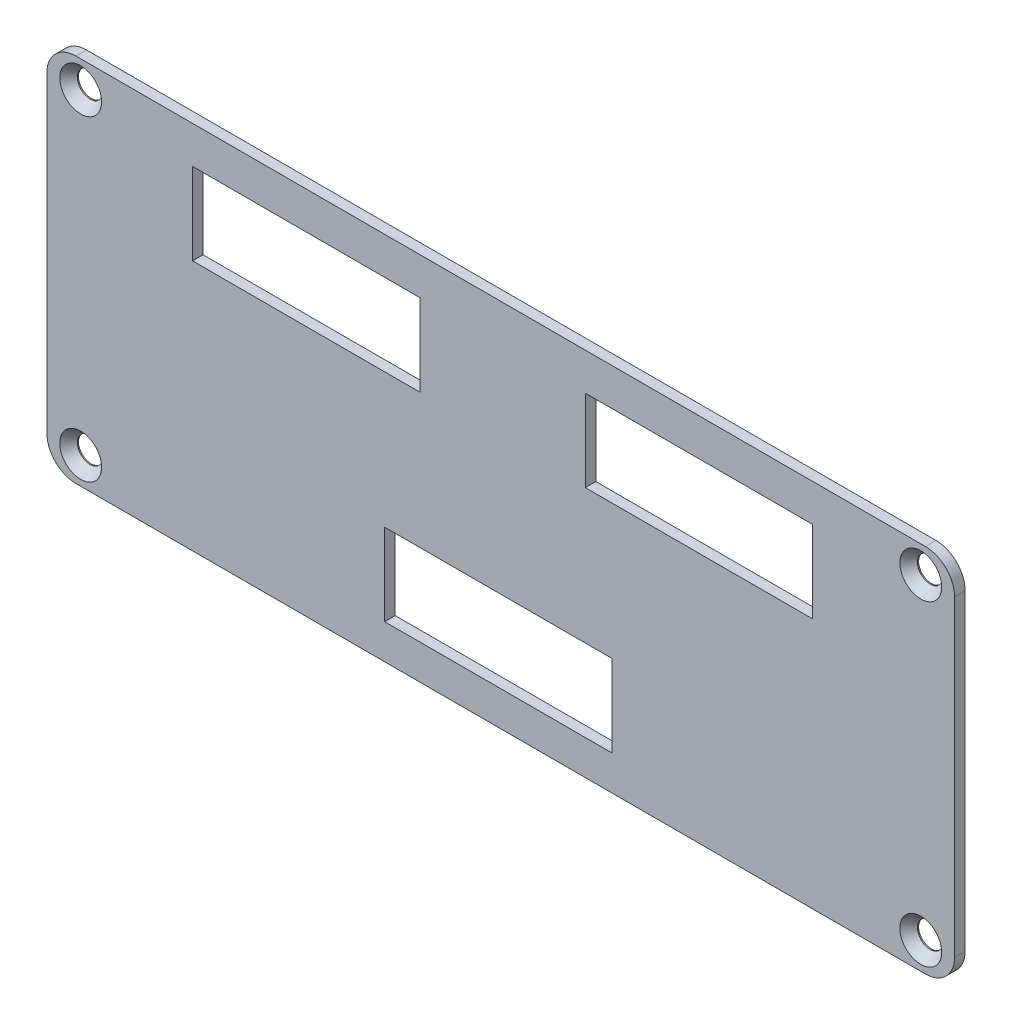
ISO-10303-21;
HEADER;
FILE_DESCRIPTION(('STEP AP214'),'2;1');
FILE_NAME('part.step','',(''),(''),'','','');
FILE_SCHEMA(('AUTOMOTIVE_DESIGN { 1 0 10303 214 1 1 1 1 }'));
ENDSEC;
DATA;
#1=APPLICATION_CONTEXT('core data for automotive mechanical design processes');
#2=APPLICATION_PROTOCOL_DEFINITION('international standard','automotive_design',2000,#1);
#3=PRODUCT_CONTEXT('',#1,'mechanical');
#4=PRODUCT('Part','Part','',(#3));
#5=PRODUCT_RELATED_PRODUCT_CATEGORY('part','',(#4));
#6=PRODUCT_DEFINITION_FORMATION('','',#4);
#7=PRODUCT_DEFINITION_CONTEXT('part definition',#1,'design');
#8=PRODUCT_DEFINITION('design','',#6,#7);
#9=PRODUCT_DEFINITION_SHAPE('','',#8);
#10=(LENGTH_UNIT() NAMED_UNIT(*) SI_UNIT(.MILLI.,.METRE.));
#11=(NAMED_UNIT(*) PLANE_ANGLE_UNIT() SI_UNIT($,.RADIAN.));
#12=(NAMED_UNIT(*) SI_UNIT($,.STERADIAN.) SOLID_ANGLE_UNIT());
#13=UNCERTAINTY_MEASURE_WITH_UNIT(LENGTH_MEASURE(1.E-05),#10,'distance_accuracy_value','');
#14=(GEOMETRIC_REPRESENTATION_CONTEXT(3) GLOBAL_UNCERTAINTY_ASSIGNED_CONTEXT((#13)) GLOBAL_UNIT_ASSIGNED_CONTEXT((#10,
#11,#12)) REPRESENTATION_CONTEXT('',''));
#15=CARTESIAN_POINT('',(0.,0.,0.));
#16=DIRECTION('',(0.,0.,1.));
#17=DIRECTION('',(1.,0.,0.));
#18=AXIS2_PLACEMENT_3D('',#15,#16,#17);
#19=CARTESIAN_POINT('',(0.,0.,1.45));
#20=DIRECTION('',(1.,0.,0.));
#21=DIRECTION('',(0.,1.,0.));
#22=AXIS2_PLACEMENT_3D('',#19,#20,#21);
#23=PLANE('',#22);
#24=DIRECTION('',(0.,-1.,0.));
#25=VECTOR('',#24,1.);
#26=CARTESIAN_POINT('',(0.,0.,1.45));
#27=LINE('',#26,#25);
#28=CARTESIAN_POINT('',(0.,-4.,1.45));
#29=VERTEX_POINT('',#28);
#30=CARTESIAN_POINT('',(0.,-46.9,1.45));
#31=VERTEX_POINT('',#30);
#32=EDGE_CURVE('E305',#29,#31,#27,.T.);
#33=ORIENTED_EDGE('',*,*,#32,.F.);
#34=DIRECTION('',(0.,0.,-1.));
#35=VECTOR('',#34,1.);
#36=CARTESIAN_POINT('',(0.,-4.,1.45));
#37=LINE('',#36,#35);
#38=CARTESIAN_POINT('',(0.,-4.,0.));
#39=VERTEX_POINT('',#38);
#40=EDGE_CURVE('E330',#29,#39,#37,.T.);
#41=ORIENTED_EDGE('',*,*,#40,.T.);
#42=DIRECTION('',(0.,-1.,0.));
#43=VECTOR('',#42,1.);
#44=CARTESIAN_POINT('',(0.,0.,0.));
#45=LINE('',#44,#43);
#46=CARTESIAN_POINT('',(0.,-46.9,0.));
#47=VERTEX_POINT('',#46);
#48=EDGE_CURVE('E304',#39,#47,#45,.T.);
#49=ORIENTED_EDGE('',*,*,#48,.T.);
#50=DIRECTION('',(0.,0.,-1.));
#51=VECTOR('',#50,1.);
#52=CARTESIAN_POINT('',(0.,-46.9,1.45));
#53=LINE('',#52,#51);
#54=EDGE_CURVE('E318',#47,#31,#53,.F.);
#55=ORIENTED_EDGE('',*,*,#54,.T.);
#56=EDGE_LOOP('',(#33,#41,#49,#55));
#57=FACE_BOUND('',#56,.T.);
#58=ADVANCED_FACE('F37',(#57),#23,.F.);
#59=CARTESIAN_POINT('',(0.,-50.9,1.45));
#60=DIRECTION('',(0.,1.,0.));
#61=DIRECTION('',(0.,0.,1.));
#62=AXIS2_PLACEMENT_3D('',#59,#60,#61);
#63=PLANE('',#62);
#64=DIRECTION('',(1.,0.,0.));
#65=VECTOR('',#64,1.);
#66=CARTESIAN_POINT('',(0.,-50.9,0.));
#67=LINE('',#66,#65);
#68=CARTESIAN_POINT('',(4.00000000000001,-50.9,0.));
#69=VERTEX_POINT('',#68);
#70=CARTESIAN_POINT('',(120.8,-50.9,0.));
#71=VERTEX_POINT('',#70);
#72=EDGE_CURVE('E321',#69,#71,#67,.T.);
#73=ORIENTED_EDGE('',*,*,#72,.T.);
#74=DIRECTION('',(0.,0.,-1.));
#75=VECTOR('',#74,1.);
#76=CARTESIAN_POINT('',(120.8,-50.9,1.45));
#77=LINE('',#76,#75);
#78=CARTESIAN_POINT('',(120.8,-50.9,1.45));
#79=VERTEX_POINT('',#78);
#80=EDGE_CURVE('E11',#71,#79,#77,.F.);
#81=ORIENTED_EDGE('',*,*,#80,.T.);
#82=DIRECTION('',(1.,0.,0.));
#83=VECTOR('',#82,1.);
#84=CARTESIAN_POINT('',(0.,-50.9,1.45));
#85=LINE('',#84,#83);
#86=CARTESIAN_POINT('',(4.00000000000001,-50.9,1.45));
#87=VERTEX_POINT('',#86);
#88=EDGE_CURVE('E308',#87,#79,#85,.T.);
#89=ORIENTED_EDGE('',*,*,#88,.F.);
#90=DIRECTION('',(0.,0.,-1.));
#91=VECTOR('',#90,1.);
#92=CARTESIAN_POINT('',(4.00000000000001,-50.9,1.45));
#93=LINE('',#92,#91);
#94=EDGE_CURVE('E45',#87,#69,#93,.T.);
#95=ORIENTED_EDGE('',*,*,#94,.T.);
#96=EDGE_LOOP('',(#73,#81,#89,#95));
#97=FACE_BOUND('',#96,.T.);
#98=ADVANCED_FACE('F363',(#97),#63,.F.);
#99=CARTESIAN_POINT('',(124.8,0.,1.45));
#100=DIRECTION('',(-1.,0.,0.));
#101=DIRECTION('',(0.,0.,1.));
#102=AXIS2_PLACEMENT_3D('',#99,#100,#101);
#103=PLANE('',#102);
#104=DIRECTION('',(0.,1.,0.));
#105=VECTOR('',#104,1.);
#106=CARTESIAN_POINT('',(124.8,0.,0.));
#107=LINE('',#106,#105);
#108=CARTESIAN_POINT('',(124.8,-46.9,0.));
#109=VERTEX_POINT('',#108);
#110=CARTESIAN_POINT('',(124.8,-4.,0.));
#111=VERTEX_POINT('',#110);
#112=EDGE_CURVE('E324',#109,#111,#107,.T.);
#113=ORIENTED_EDGE('',*,*,#112,.T.);
#114=DIRECTION('',(0.,0.,-1.));
#115=VECTOR('',#114,1.);
#116=CARTESIAN_POINT('',(124.8,-4.,1.45));
#117=LINE('',#116,#115);
#118=CARTESIAN_POINT('',(124.8,-4.,1.45));
#119=VERTEX_POINT('',#118);
#120=EDGE_CURVE('E357',#111,#119,#117,.F.);
#121=ORIENTED_EDGE('',*,*,#120,.T.);
#122=DIRECTION('',(0.,1.,0.));
#123=VECTOR('',#122,1.);
#124=CARTESIAN_POINT('',(124.8,0.,1.45));
#125=LINE('',#124,#123);
#126=CARTESIAN_POINT('',(124.8,-46.9,1.45));
#127=VERTEX_POINT('',#126);
#128=EDGE_CURVE('E312',#127,#119,#125,.T.);
#129=ORIENTED_EDGE('',*,*,#128,.F.);
#130=DIRECTION('',(0.,0.,-1.));
#131=VECTOR('',#130,1.);
#132=CARTESIAN_POINT('',(124.8,-46.9,1.45));
#133=LINE('',#132,#131);
#134=EDGE_CURVE('E354',#127,#109,#133,.T.);
#135=ORIENTED_EDGE('',*,*,#134,.T.);
#136=EDGE_LOOP('',(#113,#121,#129,#135));
#137=FACE_BOUND('',#136,.T.);
#138=ADVANCED_FACE('F377',(#137),#103,.F.);
#139=CARTESIAN_POINT('',(0.,0.,1.45));
#140=DIRECTION('',(0.,-1.,0.));
#141=DIRECTION('',(0.,0.,-1.));
#142=AXIS2_PLACEMENT_3D('',#139,#140,#141);
#143=PLANE('',#142);
#144=DIRECTION('',(-1.,0.,0.));
#145=VECTOR('',#144,1.);
#146=CARTESIAN_POINT('',(0.,0.,0.));
#147=LINE('',#146,#145);
#148=CARTESIAN_POINT('',(120.8,0.,0.));
#149=VERTEX_POINT('',#148);
#150=CARTESIAN_POINT('',(4.,0.,0.));
#151=VERTEX_POINT('',#150);
#152=EDGE_CURVE('E309',#149,#151,#147,.T.);
#153=ORIENTED_EDGE('',*,*,#152,.T.);
#154=DIRECTION('',(0.,0.,-1.));
#155=VECTOR('',#154,1.);
#156=CARTESIAN_POINT('',(4.,0.,1.45));
#157=LINE('',#156,#155);
#158=CARTESIAN_POINT('',(4.,0.,1.45));
#159=VERTEX_POINT('',#158);
#160=EDGE_CURVE('E344',#151,#159,#157,.F.);
#161=ORIENTED_EDGE('',*,*,#160,.T.);
#162=DIRECTION('',(-1.,0.,0.));
#163=VECTOR('',#162,1.);
#164=CARTESIAN_POINT('',(0.,0.,1.45));
#165=LINE('',#164,#163);
#166=CARTESIAN_POINT('',(120.8,0.,1.45));
#167=VERTEX_POINT('',#166);
#168=EDGE_CURVE('E315',#167,#159,#165,.T.);
#169=ORIENTED_EDGE('',*,*,#168,.F.);
#170=DIRECTION('',(0.,0.,-1.));
#171=VECTOR('',#170,1.);
#172=CARTESIAN_POINT('',(120.8,0.,1.45));
#173=LINE('',#172,#171);
#174=EDGE_CURVE('E341',#167,#149,#173,.T.);
#175=ORIENTED_EDGE('',*,*,#174,.T.);
#176=EDGE_LOOP('',(#153,#161,#169,#175));
#177=FACE_BOUND('',#176,.T.);
#178=ADVANCED_FACE('F387',(#177),#143,.F.);
#179=CARTESIAN_POINT('',(0.,0.,1.45));
#180=DIRECTION('',(0.,0.,1.));
#181=DIRECTION('',(1.,0.,0.));
#182=AXIS2_PLACEMENT_3D('',#179,#180,#181);
#183=PLANE('',#182);
#184=DIRECTION('',(0.,-1.,0.));
#185=VECTOR('',#184,1.);
#186=CARTESIAN_POINT('',(77.694,0.,1.45));
#187=LINE('',#186,#185);
#188=CARTESIAN_POINT('',(77.694,-34.8750000000001,1.45));
#189=VERTEX_POINT('',#188);
#190=CARTESIAN_POINT('',(77.694,-46.125,1.45));
#191=VERTEX_POINT('',#190);
#192=EDGE_CURVE('E228',#189,#191,#187,.T.);
#193=ORIENTED_EDGE('',*,*,#192,.T.);
#194=DIRECTION('',(1.,0.,0.));
#195=VECTOR('',#194,1.);
#196=CARTESIAN_POINT('',(0.,-46.1249999999999,1.45));
#197=LINE('',#196,#195);
#198=CARTESIAN_POINT('',(46.444,-46.1249999999999,1.45));
#199=VERTEX_POINT('',#198);
#200=EDGE_CURVE('E192',#199,#191,#197,.T.);
#201=ORIENTED_EDGE('',*,*,#200,.F.);
#202=DIRECTION('',(0.,-1.,0.));
#203=VECTOR('',#202,1.);
#204=CARTESIAN_POINT('',(46.444,0.,1.45));
#205=LINE('',#204,#203);
#206=CARTESIAN_POINT('',(46.444,-34.875,1.45));
#207=VERTEX_POINT('',#206);
#208=EDGE_CURVE('E52',#207,#199,#205,.T.);
#209=ORIENTED_EDGE('',*,*,#208,.F.);
#210=DIRECTION('',(1.,0.,0.));
#211=VECTOR('',#210,1.);
#212=CARTESIAN_POINT('',(0.,-34.875,1.45));
#213=LINE('',#212,#211);
#214=EDGE_CURVE('E223',#207,#189,#213,.T.);
#215=ORIENTED_EDGE('',*,*,#214,.T.);
#216=EDGE_LOOP('',(#193,#201,#209,#215));
#217=FACE_BOUND('',#216,.T.);
#218=DIRECTION('',(0.,-1.,0.));
#219=VECTOR('',#218,1.);
#220=CARTESIAN_POINT('',(105.276000000001,0.,1.45));
#221=LINE('',#220,#219);
#222=CARTESIAN_POINT('',(105.276000000001,-5.125,1.45));
#223=VERTEX_POINT('',#222);
#224=CARTESIAN_POINT('',(105.276000000001,-16.375,1.45));
#225=VERTEX_POINT('',#224);
#226=EDGE_CURVE('E185',#223,#225,#221,.T.);
#227=ORIENTED_EDGE('',*,*,#226,.T.);
#228=DIRECTION('',(1.,0.,0.));
#229=VECTOR('',#228,1.);
#230=CARTESIAN_POINT('',(0.,-16.375,1.45));
#231=LINE('',#230,#229);
#232=CARTESIAN_POINT('',(74.0260000000014,-16.375,1.45));
#233=VERTEX_POINT('',#232);
#234=EDGE_CURVE('E201',#233,#225,#231,.T.);
#235=ORIENTED_EDGE('',*,*,#234,.F.);
#236=DIRECTION('',(0.,-1.,0.));
#237=VECTOR('',#236,1.);
#238=CARTESIAN_POINT('',(74.0260000000014,0.,1.45));
#239=LINE('',#238,#237);
#240=CARTESIAN_POINT('',(74.0260000000014,-5.125,1.45));
#241=VERTEX_POINT('',#240);
#242=EDGE_CURVE('E60',#241,#233,#239,.T.);
#243=ORIENTED_EDGE('',*,*,#242,.F.);
#244=DIRECTION('',(1.,0.,0.));
#245=VECTOR('',#244,1.);
#246=CARTESIAN_POINT('',(0.,-5.125,1.45));
#247=LINE('',#246,#245);
#248=EDGE_CURVE('E177',#241,#223,#247,.T.);
#249=ORIENTED_EDGE('',*,*,#248,.T.);
#250=EDGE_LOOP('',(#227,#235,#243,#249));
#251=FACE_BOUND('',#250,.T.);
#252=DIRECTION('',(0.,-1.,0.));
#253=VECTOR('',#252,1.);
#254=CARTESIAN_POINT('',(51.2759999999999,0.,1.45));
#255=LINE('',#254,#253);
#256=CARTESIAN_POINT('',(51.2759999999999,-5.12499999999999,1.45));
#257=VERTEX_POINT('',#256);
#258=CARTESIAN_POINT('',(51.2759999999999,-16.375,1.45));
#259=VERTEX_POINT('',#258);
#260=EDGE_CURVE('E202',#257,#259,#255,.T.);
#261=ORIENTED_EDGE('',*,*,#260,.T.);
#262=DIRECTION('',(1.,0.,0.));
#263=VECTOR('',#262,1.);
#264=CARTESIAN_POINT('',(0.,-16.375,1.45));
#265=LINE('',#264,#263);
#266=CARTESIAN_POINT('',(20.0259999999999,-16.375,1.45));
#267=VERTEX_POINT('',#266);
#268=EDGE_CURVE('E253',#267,#259,#265,.T.);
#269=ORIENTED_EDGE('',*,*,#268,.F.);
#270=DIRECTION('',(0.,-1.,0.));
#271=VECTOR('',#270,1.);
#272=CARTESIAN_POINT('',(20.0259999999999,0.,1.45));
#273=LINE('',#272,#271);
#274=CARTESIAN_POINT('',(20.0259999999999,-5.125,1.45));
#275=VERTEX_POINT('',#274);
#276=EDGE_CURVE('E250',#275,#267,#273,.T.);
#277=ORIENTED_EDGE('',*,*,#276,.F.);
#278=DIRECTION('',(1.,0.,0.));
#279=VECTOR('',#278,1.);
#280=CARTESIAN_POINT('',(0.,-5.125,1.45));
#281=LINE('',#280,#279);
#282=EDGE_CURVE('E254',#275,#257,#281,.T.);
#283=ORIENTED_EDGE('',*,*,#282,.T.);
#284=EDGE_LOOP('',(#261,#269,#277,#283));
#285=FACE_BOUND('',#284,.T.);
#286=CARTESIAN_POINT('',(4.64999999999999,-3.7,1.45));
#287=DIRECTION('',(0.,0.,1.));
#288=DIRECTION('',(1.,0.,0.));
#289=AXIS2_PLACEMENT_3D('',#286,#287,#288);
#290=CIRCLE('',#289,2.875);
#291=CARTESIAN_POINT('',(7.52499999999999,-3.7,1.45));
#292=VERTEX_POINT('',#291);
#293=EDGE_CURVE('E263',#292,#292,#290,.T.);
#294=ORIENTED_EDGE('',*,*,#293,.F.);
#295=EDGE_LOOP('',(#294));
#296=FACE_BOUND('',#295,.T.);
#297=CARTESIAN_POINT('',(120.15,-3.7,1.45));
#298=DIRECTION('',(0.,0.,1.));
#299=DIRECTION('',(1.,0.,0.));
#300=AXIS2_PLACEMENT_3D('',#297,#298,#299);
#301=CIRCLE('',#300,2.875);
#302=CARTESIAN_POINT('',(123.025,-3.7,1.45));
#303=VERTEX_POINT('',#302);
#304=EDGE_CURVE('E277',#303,#303,#301,.T.);
#305=ORIENTED_EDGE('',*,*,#304,.F.);
#306=EDGE_LOOP('',(#305));
#307=FACE_BOUND('',#306,.T.);
#308=CARTESIAN_POINT('',(120.15,-47.2,1.45));
#309=DIRECTION('',(0.,0.,1.));
#310=DIRECTION('',(1.,0.,0.));
#311=AXIS2_PLACEMENT_3D('',#308,#309,#310);
#312=CIRCLE('',#311,2.875);
#313=CARTESIAN_POINT('',(123.025,-47.2,1.45));
#314=VERTEX_POINT('',#313);
#315=EDGE_CURVE('E286',#314,#314,#312,.T.);
#316=ORIENTED_EDGE('',*,*,#315,.F.);
#317=EDGE_LOOP('',(#316));
#318=FACE_BOUND('',#317,.T.);
#319=CARTESIAN_POINT('',(4.64999999999999,-47.2,1.45));
#320=DIRECTION('',(0.,0.,1.));
#321=DIRECTION('',(1.,0.,0.));
#322=AXIS2_PLACEMENT_3D('',#319,#320,#321);
#323=CIRCLE('',#322,2.875);
#324=CARTESIAN_POINT('',(7.52499999999999,-47.2,1.45));
#325=VERTEX_POINT('',#324);
#326=EDGE_CURVE('E295',#325,#325,#323,.T.);
#327=ORIENTED_EDGE('',*,*,#326,.F.);
#328=EDGE_LOOP('',(#327));
#329=FACE_BOUND('',#328,.T.);
#330=ORIENTED_EDGE('',*,*,#168,.T.);
#331=CARTESIAN_POINT('',(4.,-4.,1.45));
#332=DIRECTION('',(0.,0.,1.));
#333=DIRECTION('',(1.,0.,0.));
#334=AXIS2_PLACEMENT_3D('',#331,#332,#333);
#335=CIRCLE('',#334,4.);
#336=EDGE_CURVE('E352',#159,#29,#335,.T.);
#337=ORIENTED_EDGE('',*,*,#336,.T.);
#338=ORIENTED_EDGE('',*,*,#32,.T.);
#339=CARTESIAN_POINT('',(4.00000000000001,-46.9,1.45));
#340=DIRECTION('',(0.,0.,1.));
#341=DIRECTION('',(1.,0.,0.));
#342=AXIS2_PLACEMENT_3D('',#339,#340,#341);
#343=CIRCLE('',#342,4.);
#344=EDGE_CURVE('E346',#31,#87,#343,.T.);
#345=ORIENTED_EDGE('',*,*,#344,.T.);
#346=ORIENTED_EDGE('',*,*,#88,.T.);
#347=CARTESIAN_POINT('',(120.8,-46.9,1.45));
#348=DIRECTION('',(0.,0.,1.));
#349=DIRECTION('',(1.,0.,0.));
#350=AXIS2_PLACEMENT_3D('',#347,#348,#349);
#351=CIRCLE('',#350,4.);
#352=EDGE_CURVE('E348',#79,#127,#351,.T.);
#353=ORIENTED_EDGE('',*,*,#352,.T.);
#354=ORIENTED_EDGE('',*,*,#128,.T.);
#355=CARTESIAN_POINT('',(120.8,-4.,1.45));
#356=DIRECTION('',(0.,0.,1.));
#357=DIRECTION('',(1.,0.,0.));
#358=AXIS2_PLACEMENT_3D('',#355,#356,#357);
#359=CIRCLE('',#358,4.);
#360=EDGE_CURVE('E350',#119,#167,#359,.T.);
#361=ORIENTED_EDGE('',*,*,#360,.T.);
#362=EDGE_LOOP('',(#330,#337,#338,#345,#346,#353,#354,#361));
#363=FACE_BOUND('',#362,.T.);
#364=ADVANCED_FACE('F194',(#217,#251,#285,#296,#307,#318,#329,#363),#183,.T.);
#365=CARTESIAN_POINT('',(0.,0.,0.));
#366=DIRECTION('',(0.,0.,1.));
#367=DIRECTION('',(1.,0.,0.));
#368=AXIS2_PLACEMENT_3D('',#365,#366,#367);
#369=PLANE('',#368);
#370=DIRECTION('',(1.,0.,0.));
#371=VECTOR('',#370,1.);
#372=CARTESIAN_POINT('',(0.,-46.1249999999999,0.));
#373=LINE('',#372,#371);
#374=CARTESIAN_POINT('',(46.444,-46.1249999999999,0.));
#375=VERTEX_POINT('',#374);
#376=CARTESIAN_POINT('',(77.694,-46.125,0.));
#377=VERTEX_POINT('',#376);
#378=EDGE_CURVE('E209',#375,#377,#373,.T.);
#379=ORIENTED_EDGE('',*,*,#378,.T.);
#380=DIRECTION('',(0.,-1.,0.));
#381=VECTOR('',#380,1.);
#382=CARTESIAN_POINT('',(77.694,0.,0.));
#383=LINE('',#382,#381);
#384=CARTESIAN_POINT('',(77.694,-34.8750000000001,0.));
#385=VERTEX_POINT('',#384);
#386=EDGE_CURVE('E212',#385,#377,#383,.T.);
#387=ORIENTED_EDGE('',*,*,#386,.F.);
#388=DIRECTION('',(1.,0.,0.));
#389=VECTOR('',#388,1.);
#390=CARTESIAN_POINT('',(0.,-34.875,0.));
#391=LINE('',#390,#389);
#392=CARTESIAN_POINT('',(46.444,-34.875,0.));
#393=VERTEX_POINT('',#392);
#394=EDGE_CURVE('E218',#393,#385,#391,.T.);
#395=ORIENTED_EDGE('',*,*,#394,.F.);
#396=DIRECTION('',(0.,-1.,0.));
#397=VECTOR('',#396,1.);
#398=CARTESIAN_POINT('',(46.444,0.,0.));
#399=LINE('',#398,#397);
#400=EDGE_CURVE('E214',#393,#375,#399,.T.);
#401=ORIENTED_EDGE('',*,*,#400,.T.);
#402=EDGE_LOOP('',(#379,#387,#395,#401));
#403=FACE_BOUND('',#402,.T.);
#404=DIRECTION('',(1.,0.,0.));
#405=VECTOR('',#404,1.);
#406=CARTESIAN_POINT('',(0.,-16.375,0.));
#407=LINE('',#406,#405);
#408=CARTESIAN_POINT('',(74.0260000000014,-16.375,0.));
#409=VERTEX_POINT('',#408);
#410=CARTESIAN_POINT('',(105.276000000001,-16.375,0.));
#411=VERTEX_POINT('',#410);
#412=EDGE_CURVE('E207',#409,#411,#407,.T.);
#413=ORIENTED_EDGE('',*,*,#412,.T.);
#414=DIRECTION('',(0.,-1.,0.));
#415=VECTOR('',#414,1.);
#416=CARTESIAN_POINT('',(105.276000000001,0.,0.));
#417=LINE('',#416,#415);
#418=CARTESIAN_POINT('',(105.276000000001,-5.125,0.));
#419=VERTEX_POINT('',#418);
#420=EDGE_CURVE('E719',#419,#411,#417,.T.);
#421=ORIENTED_EDGE('',*,*,#420,.F.);
#422=DIRECTION('',(1.,0.,0.));
#423=VECTOR('',#422,1.);
#424=CARTESIAN_POINT('',(0.,-5.125,0.));
#425=LINE('',#424,#423);
#426=CARTESIAN_POINT('',(74.0260000000014,-5.125,0.));
#427=VERTEX_POINT('',#426);
#428=EDGE_CURVE('E179',#427,#419,#425,.T.);
#429=ORIENTED_EDGE('',*,*,#428,.F.);
#430=DIRECTION('',(0.,-1.,0.));
#431=VECTOR('',#430,1.);
#432=CARTESIAN_POINT('',(74.0260000000014,0.,0.));
#433=LINE('',#432,#431);
#434=EDGE_CURVE('E205',#427,#409,#433,.T.);
#435=ORIENTED_EDGE('',*,*,#434,.T.);
#436=EDGE_LOOP('',(#413,#421,#429,#435));
#437=FACE_BOUND('',#436,.T.);
#438=DIRECTION('',(1.,0.,0.));
#439=VECTOR('',#438,1.);
#440=CARTESIAN_POINT('',(0.,-16.375,0.));
#441=LINE('',#440,#439);
#442=CARTESIAN_POINT('',(20.0259999999999,-16.375,0.));
#443=VERTEX_POINT('',#442);
#444=CARTESIAN_POINT('',(51.2759999999999,-16.375,0.));
#445=VERTEX_POINT('',#444);
#446=EDGE_CURVE('E238',#443,#445,#441,.T.);
#447=ORIENTED_EDGE('',*,*,#446,.T.);
#448=DIRECTION('',(0.,-1.,0.));
#449=VECTOR('',#448,1.);
#450=CARTESIAN_POINT('',(51.2759999999999,0.,0.));
#451=LINE('',#450,#449);
#452=CARTESIAN_POINT('',(51.2759999999999,-5.12499999999999,0.));
#453=VERTEX_POINT('',#452);
#454=EDGE_CURVE('E241',#453,#445,#451,.T.);
#455=ORIENTED_EDGE('',*,*,#454,.F.);
#456=DIRECTION('',(1.,0.,0.));
#457=VECTOR('',#456,1.);
#458=CARTESIAN_POINT('',(0.,-5.125,0.));
#459=LINE('',#458,#457);
#460=CARTESIAN_POINT('',(20.0259999999999,-5.125,0.));
#461=VERTEX_POINT('',#460);
#462=EDGE_CURVE('E247',#461,#453,#459,.T.);
#463=ORIENTED_EDGE('',*,*,#462,.F.);
#464=DIRECTION('',(0.,-1.,0.));
#465=VECTOR('',#464,1.);
#466=CARTESIAN_POINT('',(20.0259999999999,0.,0.));
#467=LINE('',#466,#465);
#468=EDGE_CURVE('E243',#461,#443,#467,.T.);
#469=ORIENTED_EDGE('',*,*,#468,.T.);
#470=EDGE_LOOP('',(#447,#455,#463,#469));
#471=FACE_BOUND('',#470,.T.);
#472=CARTESIAN_POINT('',(4.64999999999999,-3.7,0.));
#473=DIRECTION('',(0.,0.,1.));
#474=DIRECTION('',(1.,0.,0.));
#475=AXIS2_PLACEMENT_3D('',#472,#473,#474);
#476=CIRCLE('',#475,1.75);
#477=CARTESIAN_POINT('',(6.39999999999999,-3.7,0.));
#478=VERTEX_POINT('',#477);
#479=EDGE_CURVE('E274',#478,#478,#476,.T.);
#480=ORIENTED_EDGE('',*,*,#479,.T.);
#481=EDGE_LOOP('',(#480));
#482=FACE_BOUND('',#481,.T.);
#483=CARTESIAN_POINT('',(120.15,-3.7,0.));
#484=DIRECTION('',(0.,0.,1.));
#485=DIRECTION('',(1.,0.,0.));
#486=AXIS2_PLACEMENT_3D('',#483,#484,#485);
#487=CIRCLE('',#486,1.75);
#488=CARTESIAN_POINT('',(121.9,-3.7,0.));
#489=VERTEX_POINT('',#488);
#490=EDGE_CURVE('E283',#489,#489,#487,.T.);
#491=ORIENTED_EDGE('',*,*,#490,.T.);
#492=EDGE_LOOP('',(#491));
#493=FACE_BOUND('',#492,.T.);
#494=CARTESIAN_POINT('',(120.15,-47.2,0.));
#495=DIRECTION('',(0.,0.,1.));
#496=DIRECTION('',(1.,0.,0.));
#497=AXIS2_PLACEMENT_3D('',#494,#495,#496);
#498=CIRCLE('',#497,1.75);
#499=CARTESIAN_POINT('',(121.9,-47.2,0.));
#500=VERTEX_POINT('',#499);
#501=EDGE_CURVE('E292',#500,#500,#498,.T.);
#502=ORIENTED_EDGE('',*,*,#501,.T.);
#503=EDGE_LOOP('',(#502));
#504=FACE_BOUND('',#503,.T.);
#505=CARTESIAN_POINT('',(4.64999999999999,-47.2,0.));
#506=DIRECTION('',(0.,0.,1.));
#507=DIRECTION('',(1.,0.,0.));
#508=AXIS2_PLACEMENT_3D('',#505,#506,#507);
#509=CIRCLE('',#508,1.75);
#510=CARTESIAN_POINT('',(6.39999999999999,-47.2,0.));
#511=VERTEX_POINT('',#510);
#512=EDGE_CURVE('E301',#511,#511,#509,.T.);
#513=ORIENTED_EDGE('',*,*,#512,.T.);
#514=EDGE_LOOP('',(#513));
#515=FACE_BOUND('',#514,.T.);
#516=ORIENTED_EDGE('',*,*,#48,.F.);
#517=CARTESIAN_POINT('',(4.,-4.,0.));
#518=DIRECTION('',(0.,0.,1.));
#519=DIRECTION('',(1.,0.,0.));
#520=AXIS2_PLACEMENT_3D('',#517,#518,#519);
#521=CIRCLE('',#520,4.);
#522=EDGE_CURVE('E339',#39,#151,#521,.F.);
#523=ORIENTED_EDGE('',*,*,#522,.T.);
#524=ORIENTED_EDGE('',*,*,#152,.F.);
#525=CARTESIAN_POINT('',(120.8,-4.,0.));
#526=DIRECTION('',(0.,0.,1.));
#527=DIRECTION('',(1.,0.,0.));
#528=AXIS2_PLACEMENT_3D('',#525,#526,#527);
#529=CIRCLE('',#528,4.);
#530=EDGE_CURVE('E337',#149,#111,#529,.F.);
#531=ORIENTED_EDGE('',*,*,#530,.T.);
#532=ORIENTED_EDGE('',*,*,#112,.F.);
#533=CARTESIAN_POINT('',(120.8,-46.9,0.));
#534=DIRECTION('',(0.,0.,1.));
#535=DIRECTION('',(1.,0.,0.));
#536=AXIS2_PLACEMENT_3D('',#533,#534,#535);
#537=CIRCLE('',#536,4.);
#538=EDGE_CURVE('E335',#109,#71,#537,.F.);
#539=ORIENTED_EDGE('',*,*,#538,.T.);
#540=ORIENTED_EDGE('',*,*,#72,.F.);
#541=CARTESIAN_POINT('',(4.00000000000001,-46.9,0.));
#542=DIRECTION('',(0.,0.,1.));
#543=DIRECTION('',(1.,0.,0.));
#544=AXIS2_PLACEMENT_3D('',#541,#542,#543);
#545=CIRCLE('',#544,4.);
#546=EDGE_CURVE('E333',#69,#47,#545,.F.);
#547=ORIENTED_EDGE('',*,*,#546,.T.);
#548=EDGE_LOOP('',(#516,#523,#524,#531,#532,#539,#540,#547));
#549=FACE_BOUND('',#548,.T.);
#550=ADVANCED_FACE('F369',(#403,#437,#471,#482,#493,#504,#515,#549),#369,.F.);
#551=CARTESIAN_POINT('',(4.64999999999999,-47.2,1.45));
#552=DIRECTION('',(0.,0.,1.));
#553=DIRECTION('',(1.,0.,0.));
#554=AXIS2_PLACEMENT_3D('',#551,#552,#553);
#555=CYLINDRICAL_SURFACE('',#554,1.75);
#556=ORIENTED_EDGE('',*,*,#512,.F.);
#557=EDGE_LOOP('',(#556));
#558=FACE_BOUND('',#557,.T.);
#559=CARTESIAN_POINT('',(4.64999999999999,-47.2,0.155835541876362));
#560=DIRECTION('',(0.,0.,1.));
#561=DIRECTION('',(1.,0.,0.));
#562=AXIS2_PLACEMENT_3D('',#559,#560,#561);
#563=CIRCLE('',#562,1.75);
#564=CARTESIAN_POINT('',(6.39999999999999,-47.2,0.155835541876362));
#565=VERTEX_POINT('',#564);
#566=EDGE_CURVE('E298',#565,#565,#563,.T.);
#567=ORIENTED_EDGE('',*,*,#566,.T.);
#568=EDGE_LOOP('',(#567));
#569=FACE_BOUND('',#568,.T.);
#570=ADVANCED_FACE('F451',(#558,#569),#555,.F.);
#571=CARTESIAN_POINT('',(4.64999999999999,-47.2,1.45));
#572=DIRECTION('',(0.,0.,1.));
#573=DIRECTION('',(1.,0.,0.));
#574=AXIS2_PLACEMENT_3D('',#571,#572,#573);
#575=CONICAL_SURFACE('',#574,2.875,0.715584993317675);
#576=ORIENTED_EDGE('',*,*,#566,.F.);
#577=EDGE_LOOP('',(#576));
#578=FACE_BOUND('',#577,.T.);
#579=ORIENTED_EDGE('',*,*,#326,.T.);
#580=EDGE_LOOP('',(#579));
#581=FACE_BOUND('',#580,.T.);
#582=ADVANCED_FACE('F588',(#578,#581),#575,.F.);
#583=CARTESIAN_POINT('',(120.15,-47.2,1.45));
#584=DIRECTION('',(0.,0.,1.));
#585=DIRECTION('',(1.,0.,0.));
#586=AXIS2_PLACEMENT_3D('',#583,#584,#585);
#587=CYLINDRICAL_SURFACE('',#586,1.75);
#588=ORIENTED_EDGE('',*,*,#501,.F.);
#589=EDGE_LOOP('',(#588));
#590=FACE_BOUND('',#589,.T.);
#591=CARTESIAN_POINT('',(120.15,-47.2,0.155835541876362));
#592=DIRECTION('',(0.,0.,1.));
#593=DIRECTION('',(1.,0.,0.));
#594=AXIS2_PLACEMENT_3D('',#591,#592,#593);
#595=CIRCLE('',#594,1.75);
#596=CARTESIAN_POINT('',(121.9,-47.2,0.155835541876362));
#597=VERTEX_POINT('',#596);
#598=EDGE_CURVE('E289',#597,#597,#595,.T.);
#599=ORIENTED_EDGE('',*,*,#598,.T.);
#600=EDGE_LOOP('',(#599));
#601=FACE_BOUND('',#600,.T.);
#602=ADVANCED_FACE('F584',(#590,#601),#587,.F.);
#603=CARTESIAN_POINT('',(120.15,-47.2,1.45));
#604=DIRECTION('',(0.,0.,1.));
#605=DIRECTION('',(1.,0.,0.));
#606=AXIS2_PLACEMENT_3D('',#603,#604,#605);
#607=CONICAL_SURFACE('',#606,2.875,0.715584993317675);
#608=ORIENTED_EDGE('',*,*,#598,.F.);
#609=EDGE_LOOP('',(#608));
#610=FACE_BOUND('',#609,.T.);
#611=ORIENTED_EDGE('',*,*,#315,.T.);
#612=EDGE_LOOP('',(#611));
#613=FACE_BOUND('',#612,.T.);
#614=ADVANCED_FACE('F580',(#610,#613),#607,.F.);
#615=CARTESIAN_POINT('',(120.15,-3.7,1.45));
#616=DIRECTION('',(0.,0.,1.));
#617=DIRECTION('',(1.,0.,0.));
#618=AXIS2_PLACEMENT_3D('',#615,#616,#617);
#619=CYLINDRICAL_SURFACE('',#618,1.75);
#620=ORIENTED_EDGE('',*,*,#490,.F.);
#621=EDGE_LOOP('',(#620));
#622=FACE_BOUND('',#621,.T.);
#623=CARTESIAN_POINT('',(120.15,-3.7,0.155835541876362));
#624=DIRECTION('',(0.,0.,1.));
#625=DIRECTION('',(1.,0.,0.));
#626=AXIS2_PLACEMENT_3D('',#623,#624,#625);
#627=CIRCLE('',#626,1.75);
#628=CARTESIAN_POINT('',(121.9,-3.7,0.155835541876362));
#629=VERTEX_POINT('',#628);
#630=EDGE_CURVE('E280',#629,#629,#627,.T.);
#631=ORIENTED_EDGE('',*,*,#630,.T.);
#632=EDGE_LOOP('',(#631));
#633=FACE_BOUND('',#632,.T.);
#634=ADVANCED_FACE('F576',(#622,#633),#619,.F.);
#635=CARTESIAN_POINT('',(120.15,-3.7,1.45));
#636=DIRECTION('',(0.,0.,1.));
#637=DIRECTION('',(1.,0.,0.));
#638=AXIS2_PLACEMENT_3D('',#635,#636,#637);
#639=CONICAL_SURFACE('',#638,2.875,0.715584993317675);
#640=ORIENTED_EDGE('',*,*,#630,.F.);
#641=EDGE_LOOP('',(#640));
#642=FACE_BOUND('',#641,.T.);
#643=ORIENTED_EDGE('',*,*,#304,.T.);
#644=EDGE_LOOP('',(#643));
#645=FACE_BOUND('',#644,.T.);
#646=ADVANCED_FACE('F572',(#642,#645),#639,.F.);
#647=CARTESIAN_POINT('',(4.64999999999999,-3.7,1.45));
#648=DIRECTION('',(0.,0.,1.));
#649=DIRECTION('',(1.,0.,0.));
#650=AXIS2_PLACEMENT_3D('',#647,#648,#649);
#651=CYLINDRICAL_SURFACE('',#650,1.75);
#652=ORIENTED_EDGE('',*,*,#479,.F.);
#653=EDGE_LOOP('',(#652));
#654=FACE_BOUND('',#653,.T.);
#655=CARTESIAN_POINT('',(4.64999999999999,-3.7,0.155835541876362));
#656=DIRECTION('',(0.,0.,1.));
#657=DIRECTION('',(1.,0.,0.));
#658=AXIS2_PLACEMENT_3D('',#655,#656,#657);
#659=CIRCLE('',#658,1.75);
#660=CARTESIAN_POINT('',(6.39999999999999,-3.7,0.155835541876362));
#661=VERTEX_POINT('',#660);
#662=EDGE_CURVE('E271',#661,#661,#659,.T.);
#663=ORIENTED_EDGE('',*,*,#662,.T.);
#664=EDGE_LOOP('',(#663));
#665=FACE_BOUND('',#664,.T.);
#666=ADVANCED_FACE('F568',(#654,#665),#651,.F.);
#667=CARTESIAN_POINT('',(4.64999999999999,-3.7,1.45));
#668=DIRECTION('',(0.,0.,1.));
#669=DIRECTION('',(1.,0.,0.));
#670=AXIS2_PLACEMENT_3D('',#667,#668,#669);
#671=CONICAL_SURFACE('',#670,2.875,0.715584993317675);
#672=ORIENTED_EDGE('',*,*,#662,.F.);
#673=EDGE_LOOP('',(#672));
#674=FACE_BOUND('',#673,.T.);
#675=ORIENTED_EDGE('',*,*,#293,.T.);
#676=EDGE_LOOP('',(#675));
#677=FACE_BOUND('',#676,.T.);
#678=ADVANCED_FACE('F415',(#674,#677),#671,.F.);
#679=CARTESIAN_POINT('',(4.,-4.,1.45));
#680=DIRECTION('',(0.,0.,-1.));
#681=DIRECTION('',(-1.,0.,0.));
#682=AXIS2_PLACEMENT_3D('',#679,#680,#681);
#683=CYLINDRICAL_SURFACE('',#682,4.);
#684=ORIENTED_EDGE('',*,*,#336,.F.);
#685=ORIENTED_EDGE('',*,*,#160,.F.);
#686=ORIENTED_EDGE('',*,*,#522,.F.);
#687=ORIENTED_EDGE('',*,*,#40,.F.);
#688=EDGE_LOOP('',(#684,#685,#686,#687));
#689=FACE_BOUND('',#688,.T.);
#690=ADVANCED_FACE('F392',(#689),#683,.T.);
#691=CARTESIAN_POINT('',(120.8,-4.,1.45));
#692=DIRECTION('',(0.,0.,-1.));
#693=DIRECTION('',(-1.,0.,0.));
#694=AXIS2_PLACEMENT_3D('',#691,#692,#693);
#695=CYLINDRICAL_SURFACE('',#694,4.);
#696=ORIENTED_EDGE('',*,*,#360,.F.);
#697=ORIENTED_EDGE('',*,*,#120,.F.);
#698=ORIENTED_EDGE('',*,*,#530,.F.);
#699=ORIENTED_EDGE('',*,*,#174,.F.);
#700=EDGE_LOOP('',(#696,#697,#698,#699));
#701=FACE_BOUND('',#700,.T.);
#702=ADVANCED_FACE('F384',(#701),#695,.T.);
#703=CARTESIAN_POINT('',(120.8,-46.9,1.45));
#704=DIRECTION('',(0.,0.,-1.));
#705=DIRECTION('',(-1.,0.,0.));
#706=AXIS2_PLACEMENT_3D('',#703,#704,#705);
#707=CYLINDRICAL_SURFACE('',#706,4.);
#708=ORIENTED_EDGE('',*,*,#352,.F.);
#709=ORIENTED_EDGE('',*,*,#80,.F.);
#710=ORIENTED_EDGE('',*,*,#538,.F.);
#711=ORIENTED_EDGE('',*,*,#134,.F.);
#712=EDGE_LOOP('',(#708,#709,#710,#711));
#713=FACE_BOUND('',#712,.T.);
#714=ADVANCED_FACE('F374',(#713),#707,.T.);
#715=CARTESIAN_POINT('',(4.00000000000001,-46.9,1.45));
#716=DIRECTION('',(0.,0.,-1.));
#717=DIRECTION('',(-1.,0.,0.));
#718=AXIS2_PLACEMENT_3D('',#715,#716,#717);
#719=CYLINDRICAL_SURFACE('',#718,4.);
#720=ORIENTED_EDGE('',*,*,#344,.F.);
#721=ORIENTED_EDGE('',*,*,#54,.F.);
#722=ORIENTED_EDGE('',*,*,#546,.F.);
#723=ORIENTED_EDGE('',*,*,#94,.F.);
#724=EDGE_LOOP('',(#720,#721,#722,#723));
#725=FACE_BOUND('',#724,.T.);
#726=ADVANCED_FACE('F39',(#725),#719,.T.);
#727=CARTESIAN_POINT('',(51.2759999999999,0.,34.6633256389661));
#728=DIRECTION('',(1.,0.,0.));
#729=DIRECTION('',(0.,0.,-1.));
#730=AXIS2_PLACEMENT_3D('',#727,#728,#729);
#731=PLANE('',#730);
#732=DIRECTION('',(0.,0.,-1.));
#733=VECTOR('',#732,1.);
#734=CARTESIAN_POINT('',(51.2759999999999,-5.12499999999999,34.6633256389661));
#735=LINE('',#734,#733);
#736=EDGE_CURVE('E257',#257,#453,#735,.T.);
#737=ORIENTED_EDGE('',*,*,#736,.T.);
#738=ORIENTED_EDGE('',*,*,#454,.T.);
#739=DIRECTION('',(0.,0.,-1.));
#740=VECTOR('',#739,1.);
#741=CARTESIAN_POINT('',(51.2759999999999,-16.375,34.6633256389661));
#742=LINE('',#741,#740);
#743=EDGE_CURVE('E258',#259,#445,#742,.T.);
#744=ORIENTED_EDGE('',*,*,#743,.F.);
#745=ORIENTED_EDGE('',*,*,#260,.F.);
#746=EDGE_LOOP('',(#737,#738,#744,#745));
#747=FACE_BOUND('',#746,.T.);
#748=ADVANCED_FACE('F397',(#747),#731,.F.);
#749=CARTESIAN_POINT('',(0.,-5.125,34.6633256389661));
#750=DIRECTION('',(0.,1.,0.));
#751=DIRECTION('',(-1.,0.,0.));
#752=AXIS2_PLACEMENT_3D('',#749,#750,#751);
#753=PLANE('',#752);
#754=DIRECTION('',(0.,0.,-1.));
#755=VECTOR('',#754,1.);
#756=CARTESIAN_POINT('',(20.0259999999999,-5.125,34.6633256389661));
#757=LINE('',#756,#755);
#758=EDGE_CURVE('E246',#275,#461,#757,.T.);
#759=ORIENTED_EDGE('',*,*,#758,.T.);
#760=ORIENTED_EDGE('',*,*,#462,.T.);
#761=ORIENTED_EDGE('',*,*,#736,.F.);
#762=ORIENTED_EDGE('',*,*,#282,.F.);
#763=EDGE_LOOP('',(#759,#760,#761,#762));
#764=FACE_BOUND('',#763,.T.);
#765=ADVANCED_FACE('F402',(#764),#753,.F.);
#766=CARTESIAN_POINT('',(20.0259999999999,0.,34.6633256389661));
#767=DIRECTION('',(1.,0.,0.));
#768=DIRECTION('',(0.,0.,-1.));
#769=AXIS2_PLACEMENT_3D('',#766,#767,#768);
#770=PLANE('',#769);
#771=ORIENTED_EDGE('',*,*,#276,.T.);
#772=DIRECTION('',(0.,0.,-1.));
#773=VECTOR('',#772,1.);
#774=CARTESIAN_POINT('',(20.0259999999999,-16.375,34.6633256389661));
#775=LINE('',#774,#773);
#776=EDGE_CURVE('E242',#267,#443,#775,.T.);
#777=ORIENTED_EDGE('',*,*,#776,.T.);
#778=ORIENTED_EDGE('',*,*,#468,.F.);
#779=ORIENTED_EDGE('',*,*,#758,.F.);
#780=EDGE_LOOP('',(#771,#777,#778,#779));
#781=FACE_BOUND('',#780,.T.);
#782=ADVANCED_FACE('F468',(#781),#770,.T.);
#783=CARTESIAN_POINT('',(0.,-16.375,34.6633256389661));
#784=DIRECTION('',(0.,1.,0.));
#785=DIRECTION('',(-1.,0.,0.));
#786=AXIS2_PLACEMENT_3D('',#783,#784,#785);
#787=PLANE('',#786);
#788=ORIENTED_EDGE('',*,*,#268,.T.);
#789=ORIENTED_EDGE('',*,*,#743,.T.);
#790=ORIENTED_EDGE('',*,*,#446,.F.);
#791=ORIENTED_EDGE('',*,*,#776,.F.);
#792=EDGE_LOOP('',(#788,#789,#790,#791));
#793=FACE_BOUND('',#792,.T.);
#794=ADVANCED_FACE('F478',(#793),#787,.T.);
#795=CARTESIAN_POINT('',(105.276000000001,0.,34.6633256389661));
#796=DIRECTION('',(1.,0.,0.));
#797=DIRECTION('',(0.,0.,-1.));
#798=AXIS2_PLACEMENT_3D('',#795,#796,#797);
#799=PLANE('',#798);
#800=DIRECTION('',(0.,0.,-1.));
#801=VECTOR('',#800,1.);
#802=CARTESIAN_POINT('',(105.276000000001,-5.125,34.6633256389661));
#803=LINE('',#802,#801);
#804=EDGE_CURVE('E173',#223,#419,#803,.T.);
#805=ORIENTED_EDGE('',*,*,#804,.T.);
#806=ORIENTED_EDGE('',*,*,#420,.T.);
#807=DIRECTION('',(0.,0.,-1.));
#808=VECTOR('',#807,1.);
#809=CARTESIAN_POINT('',(105.276000000001,-16.375,34.6633256389661));
#810=LINE('',#809,#808);
#811=EDGE_CURVE('E188',#225,#411,#810,.T.);
#812=ORIENTED_EDGE('',*,*,#811,.F.);
#813=ORIENTED_EDGE('',*,*,#226,.F.);
#814=EDGE_LOOP('',(#805,#806,#812,#813));
#815=FACE_BOUND('',#814,.T.);
#816=ADVANCED_FACE('F186',(#815),#799,.F.);
#817=CARTESIAN_POINT('',(0.,-5.125,34.6633256389661));
#818=DIRECTION('',(0.,1.,0.));
#819=DIRECTION('',(0.,0.,1.));
#820=AXIS2_PLACEMENT_3D('',#817,#818,#819);
#821=PLANE('',#820);
#822=DIRECTION('',(0.,0.,-1.));
#823=VECTOR('',#822,1.);
#824=CARTESIAN_POINT('',(74.0260000000014,-5.125,34.6633256389661));
#825=LINE('',#824,#823);
#826=EDGE_CURVE('E182',#241,#427,#825,.T.);
#827=ORIENTED_EDGE('',*,*,#826,.T.);
#828=ORIENTED_EDGE('',*,*,#428,.T.);
#829=ORIENTED_EDGE('',*,*,#804,.F.);
#830=ORIENTED_EDGE('',*,*,#248,.F.);
#831=EDGE_LOOP('',(#827,#828,#829,#830));
#832=FACE_BOUND('',#831,.T.);
#833=ADVANCED_FACE('F175',(#832),#821,.F.);
#834=CARTESIAN_POINT('',(74.0260000000014,0.,34.6633256389661));
#835=DIRECTION('',(1.,0.,0.));
#836=DIRECTION('',(0.,0.,-1.));
#837=AXIS2_PLACEMENT_3D('',#834,#835,#836);
#838=PLANE('',#837);
#839=ORIENTED_EDGE('',*,*,#242,.T.);
#840=DIRECTION('',(0.,0.,-1.));
#841=VECTOR('',#840,1.);
#842=CARTESIAN_POINT('',(74.0260000000014,-16.375,34.6633256389661));
#843=LINE('',#842,#841);
#844=EDGE_CURVE('E206',#233,#409,#843,.T.);
#845=ORIENTED_EDGE('',*,*,#844,.T.);
#846=ORIENTED_EDGE('',*,*,#434,.F.);
#847=ORIENTED_EDGE('',*,*,#826,.F.);
#848=EDGE_LOOP('',(#839,#845,#846,#847));
#849=FACE_BOUND('',#848,.T.);
#850=ADVANCED_FACE('F505',(#849),#838,.T.);
#851=CARTESIAN_POINT('',(0.,-16.375,34.6633256389661));
#852=DIRECTION('',(0.,1.,0.));
#853=DIRECTION('',(-1.,0.,0.));
#854=AXIS2_PLACEMENT_3D('',#851,#852,#853);
#855=PLANE('',#854);
#856=ORIENTED_EDGE('',*,*,#234,.T.);
#857=ORIENTED_EDGE('',*,*,#811,.T.);
#858=ORIENTED_EDGE('',*,*,#412,.F.);
#859=ORIENTED_EDGE('',*,*,#844,.F.);
#860=EDGE_LOOP('',(#856,#857,#858,#859));
#861=FACE_BOUND('',#860,.T.);
#862=ADVANCED_FACE('F514',(#861),#855,.T.);
#863=CARTESIAN_POINT('',(77.694,0.,34.6633256389661));
#864=DIRECTION('',(1.,0.,0.));
#865=DIRECTION('',(0.,1.,0.));
#866=AXIS2_PLACEMENT_3D('',#863,#864,#865);
#867=PLANE('',#866);
#868=DIRECTION('',(0.,0.,-1.));
#869=VECTOR('',#868,1.);
#870=CARTESIAN_POINT('',(77.694,-34.8750000000001,34.6633256389661));
#871=LINE('',#870,#869);
#872=EDGE_CURVE('E226',#189,#385,#871,.T.);
#873=ORIENTED_EDGE('',*,*,#872,.T.);
#874=ORIENTED_EDGE('',*,*,#386,.T.);
#875=DIRECTION('',(0.,0.,-1.));
#876=VECTOR('',#875,1.);
#877=CARTESIAN_POINT('',(77.694,-46.125,34.6633256389661));
#878=LINE('',#877,#876);
#879=EDGE_CURVE('E227',#191,#377,#878,.T.);
#880=ORIENTED_EDGE('',*,*,#879,.F.);
#881=ORIENTED_EDGE('',*,*,#192,.F.);
#882=EDGE_LOOP('',(#873,#874,#880,#881));
#883=FACE_BOUND('',#882,.T.);
#884=ADVANCED_FACE('F523',(#883),#867,.F.);
#885=CARTESIAN_POINT('',(0.,-34.875,34.6633256389661));
#886=DIRECTION('',(0.,1.,0.));
#887=DIRECTION('',(-1.,0.,0.));
#888=AXIS2_PLACEMENT_3D('',#885,#886,#887);
#889=PLANE('',#888);
#890=DIRECTION('',(0.,0.,-1.));
#891=VECTOR('',#890,1.);
#892=CARTESIAN_POINT('',(46.444,-34.875,34.6633256389661));
#893=LINE('',#892,#891);
#894=EDGE_CURVE('E217',#207,#393,#893,.T.);
#895=ORIENTED_EDGE('',*,*,#894,.T.);
#896=ORIENTED_EDGE('',*,*,#394,.T.);
#897=ORIENTED_EDGE('',*,*,#872,.F.);
#898=ORIENTED_EDGE('',*,*,#214,.F.);
#899=EDGE_LOOP('',(#895,#896,#897,#898));
#900=FACE_BOUND('',#899,.T.);
#901=ADVANCED_FACE('F533',(#900),#889,.F.);
#902=CARTESIAN_POINT('',(46.444,0.,34.6633256389661));
#903=DIRECTION('',(1.,0.,0.));
#904=DIRECTION('',(0.,0.,-1.));
#905=AXIS2_PLACEMENT_3D('',#902,#903,#904);
#906=PLANE('',#905);
#907=ORIENTED_EDGE('',*,*,#208,.T.);
#908=DIRECTION('',(0.,0.,-1.));
#909=VECTOR('',#908,1.);
#910=CARTESIAN_POINT('',(46.444,-46.1249999999999,34.6633256389661));
#911=LINE('',#910,#909);
#912=EDGE_CURVE('E213',#199,#375,#911,.T.);
#913=ORIENTED_EDGE('',*,*,#912,.T.);
#914=ORIENTED_EDGE('',*,*,#400,.F.);
#915=ORIENTED_EDGE('',*,*,#894,.F.);
#916=EDGE_LOOP('',(#907,#913,#914,#915));
#917=FACE_BOUND('',#916,.T.);
#918=ADVANCED_FACE('F543',(#917),#906,.T.);
#919=CARTESIAN_POINT('',(0.,-46.1249999999999,34.6633256389661));
#920=DIRECTION('',(0.,1.,0.));
#921=DIRECTION('',(-1.,0.,0.));
#922=AXIS2_PLACEMENT_3D('',#919,#920,#921);
#923=PLANE('',#922);
#924=ORIENTED_EDGE('',*,*,#200,.T.);
#925=ORIENTED_EDGE('',*,*,#879,.T.);
#926=ORIENTED_EDGE('',*,*,#378,.F.);
#927=ORIENTED_EDGE('',*,*,#912,.F.);
#928=EDGE_LOOP('',(#924,#925,#926,#927));
#929=FACE_BOUND('',#928,.T.);
#930=ADVANCED_FACE('F553',(#929),#923,.T.);
#931=CLOSED_SHELL('',(#58,#98,#138,#178,#364,#550,#570,#582,#602,#614,#634,#646,#666,#678,#690,
#702,#714,#726,#748,#765,#782,#794,#816,#833,#850,#862,#884,#901,#918,#930));
#932=MANIFOLD_SOLID_BREP('B2',#931);
#933=ADVANCED_BREP_SHAPE_REPRESENTATION('',(#18,#932),#14);
#934=SHAPE_DEFINITION_REPRESENTATION(#9,#933);
ENDSEC;
END-ISO-10303-21;
